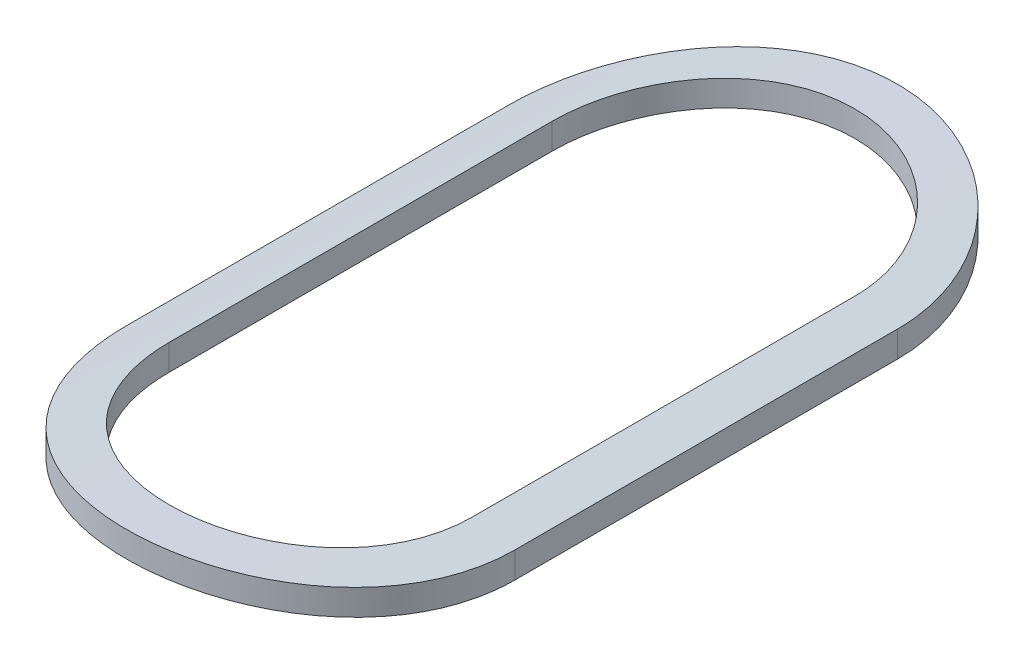
ISO-10303-21;
HEADER;
FILE_DESCRIPTION(('STEP AP214'),'2;1');
FILE_NAME('part.step','',(''),(''),'','','');
FILE_SCHEMA(('AUTOMOTIVE_DESIGN { 1 0 10303 214 1 1 1 1 }'));
ENDSEC;
DATA;
#1=APPLICATION_CONTEXT('core data for automotive mechanical design processes');
#2=APPLICATION_PROTOCOL_DEFINITION('international standard','automotive_design',2000,#1);
#3=PRODUCT_CONTEXT('',#1,'mechanical');
#4=PRODUCT('Part','Part','',(#3));
#5=PRODUCT_RELATED_PRODUCT_CATEGORY('part','',(#4));
#6=PRODUCT_DEFINITION_FORMATION('','',#4);
#7=PRODUCT_DEFINITION_CONTEXT('part definition',#1,'design');
#8=PRODUCT_DEFINITION('design','',#6,#7);
#9=PRODUCT_DEFINITION_SHAPE('','',#8);
#10=(LENGTH_UNIT() NAMED_UNIT(*) SI_UNIT(.MILLI.,.METRE.));
#11=(NAMED_UNIT(*) PLANE_ANGLE_UNIT() SI_UNIT($,.RADIAN.));
#12=(NAMED_UNIT(*) SI_UNIT($,.STERADIAN.) SOLID_ANGLE_UNIT());
#13=UNCERTAINTY_MEASURE_WITH_UNIT(LENGTH_MEASURE(1.E-05),#10,'distance_accuracy_value','');
#14=(GEOMETRIC_REPRESENTATION_CONTEXT(3) GLOBAL_UNCERTAINTY_ASSIGNED_CONTEXT((#13)) GLOBAL_UNIT_ASSIGNED_CONTEXT((#10,
#11,#12)) REPRESENTATION_CONTEXT('',''));
#15=CARTESIAN_POINT('',(0.,0.,0.));
#16=DIRECTION('',(0.,0.,1.));
#17=DIRECTION('',(1.,0.,0.));
#18=AXIS2_PLACEMENT_3D('',#15,#16,#17);
#19=CARTESIAN_POINT('',(-175.2707109821,-62.9180736437962,1.42682282483735));
#20=DIRECTION('',(0.,0.,1.));
#21=DIRECTION('',(1.,0.,0.));
#22=AXIS2_PLACEMENT_3D('',#19,#20,#21);
#23=CYLINDRICAL_SURFACE('',#22,5.);
#24=CARTESIAN_POINT('',(-174.562352977331,-57.9685050830951,-0.626714267221802));
#25=CARTESIAN_POINT('',(-174.56231819202,-57.9685236249811,-0.587075440803523));
#26=CARTESIAN_POINT('',(-174.565677996493,-57.9680294147791,-0.547451265399282));
#27=CARTESIAN_POINT('',(-174.578924725972,-57.9661536270468,-0.469375725013072));
#28=CARTESIAN_POINT('',(-174.588804133438,-57.9647730715818,-0.430923062558488));
#29=CARTESIAN_POINT('',(-174.614832857679,-57.9612616354489,-0.356226993143566));
#30=CARTESIAN_POINT('',(-174.630983979941,-57.9591305387334,-0.319984225842004));
#31=CARTESIAN_POINT('',(-174.669077247436,-57.9543647067663,-0.250723448485034));
#32=CARTESIAN_POINT('',(-174.691019134295,-57.9517299939866,-0.217705294642949));
#33=CARTESIAN_POINT('',(-174.740238549183,-57.9462315808067,-0.155598483974647));
#34=CARTESIAN_POINT('',(-174.767548783778,-57.9433665437921,-0.126535861606955));
#35=CARTESIAN_POINT('',(-174.826661618482,-57.9377423080896,-0.0733868548091715));
#36=CARTESIAN_POINT('',(-174.85846490313,-57.9349831256107,-0.049301230029893));
#37=CARTESIAN_POINT('',(-174.925826905015,-57.9298676599313,-0.00669747102001507));
#38=CARTESIAN_POINT('',(-174.961401017461,-57.9275131399999,0.0117965513089007));
#39=CARTESIAN_POINT('',(-175.035187231282,-57.9234873673329,0.0425365416853109));
#40=CARTESIAN_POINT('',(-175.073399053675,-57.9218160424669,0.0547831693542658));
#41=CARTESIAN_POINT('',(-175.151106693764,-57.9193542972137,0.0726027061890993));
#42=CARTESIAN_POINT('',(-175.190592212742,-57.9185580590577,0.0782197092632751));
#43=CARTESIAN_POINT('',(-175.269953800404,-57.9179162798542,0.082757402555431));
#44=CARTESIAN_POINT('',(-175.309829858972,-57.9180707142472,0.0816782657607643));
#45=CARTESIAN_POINT('',(-175.388537942688,-57.9193082454885,0.0728890572938922));
#46=CARTESIAN_POINT('',(-175.427375404778,-57.9203846735061,0.0652266019071842));
#47=CARTESIAN_POINT('',(-175.503207413134,-57.9233377917456,0.0435629378047652));
#48=CARTESIAN_POINT('',(-175.540201926849,-57.9252144960958,0.0295616171808006));
#49=CARTESIAN_POINT('',(-175.611444068649,-57.9295688237723,-0.00443201761331331));
#50=CARTESIAN_POINT('',(-175.64568185491,-57.9320484831863,-0.0244446862415206));
#51=CARTESIAN_POINT('',(-175.710329754601,-57.9373318406017,-0.0698773123927697));
#52=CARTESIAN_POINT('',(-175.740739797455,-57.940135544576,-0.0952973695928472));
#53=CARTESIAN_POINT('',(-175.797147093776,-57.9457827135758,-0.151084980078037));
#54=CARTESIAN_POINT('',(-175.823103896636,-57.9486263127461,-0.181493431431719));
#55=CARTESIAN_POINT('',(-175.86955966979,-57.9540098748137,-0.246267479357088));
#56=CARTESIAN_POINT('',(-175.890057044511,-57.956549748825,-0.280634228587506));
#57=CARTESIAN_POINT('',(-175.925016265224,-57.9610385580672,-0.352394026502373));
#58=CARTESIAN_POINT('',(-175.939470709579,-57.9629867678087,-0.389790719884));
#59=CARTESIAN_POINT('',(-175.961861656507,-57.9660598482316,-0.466488015576374));
#60=CARTESIAN_POINT('',(-175.969807944731,-57.9671859547476,-0.505785665031438));
#61=CARTESIAN_POINT('',(-175.975949994197,-57.9680595995502,-0.558929092149806));
#62=CARTESIAN_POINT('',(-175.977120148638,-57.9682265264067,-0.572471186339221));
#63=CARTESIAN_POINT('',(-175.978678608053,-57.9684491444339,-0.599578341048477));
#64=CARTESIAN_POINT('',(-175.979068226181,-57.9685050224289,-0.613143324503915));
#65=CARTESIAN_POINT('',(-175.979068986851,-57.9685050830926,-0.626714267221801));
#66=B_SPLINE_CURVE_WITH_KNOTS('',3,(#24,#25,#26,#27,#28,#29,#30,#31,#32,#33,#34,#35,#36,#37,#38,
#39,#40,#41,#42,#43,#44,#45,#46,#47,#48,#49,#50,#51,#52,#53,#54,#55,#56,#57,#58,#59,#60,#61,#62,
#63,#64,#65),.UNSPECIFIED.,.F.,.F.,(4,2,2,2,2,2,2,2,2,2,2,2,2,2,2,2,2,2,2,2,4),(0.,
0.118749475652929,0.237362263855814,0.356009223373581,0.474650889962778,0.594039129072952,
0.713445577251891,0.833359813547281,0.953261386262471,1.07236091244366,1.19145736183339,
1.30969958496656,1.42794389566529,1.54659318409006,1.66524465982469,1.78492258189409,
1.90463544277968,2.02449450646764,2.14417301772139,2.18493687446289,2.22563209338629),.UNSPECIFIED.);
#67=CARTESIAN_POINT('',(-174.562352977331,-57.9685050830952,-0.626714267221801));
#68=VERTEX_POINT('',#67);
#69=CARTESIAN_POINT('',(-175.97906898685,-57.9685050830925,-0.626714267221803));
#70=VERTEX_POINT('',#69);
#71=EDGE_CURVE('E173',#68,#70,#66,.T.);
#72=ORIENTED_EDGE('',*,*,#71,.T.);
#73=DIRECTION('',(0.,0.,-1.));
#74=VECTOR('',#73,1.);
#75=CARTESIAN_POINT('',(-175.97906898685,-57.9685050830925,-2.41765714717993));
#76=LINE('',#75,#74);
#77=CARTESIAN_POINT('',(-175.97906898685,-57.9685050830925,-2.41765714717993));
#78=VERTEX_POINT('',#77);
#79=EDGE_CURVE('E111',#78,#70,#76,.F.);
#80=ORIENTED_EDGE('',*,*,#79,.F.);
#81=CARTESIAN_POINT('',(-175.979068986851,-57.9685050830926,-2.41765714717993));
#82=CARTESIAN_POINT('',(-175.979103777404,-57.9685236247256,-2.45729586745361));
#83=CARTESIAN_POINT('',(-175.975743988307,-57.9680294172962,-2.49691993696254));
#84=CARTESIAN_POINT('',(-175.962497288361,-57.9661536344881,-2.57499548330385));
#85=CARTESIAN_POINT('',(-175.952617860228,-57.9647730764401,-2.61344825159397));
#86=CARTESIAN_POINT('',(-175.926588842244,-57.9612615989126,-2.68814519526376));
#87=CARTESIAN_POINT('',(-175.910437333816,-57.9591304498519,-2.72438869091649));
#88=CARTESIAN_POINT('',(-175.872343784117,-57.9543645974187,-2.79364934200575));
#89=CARTESIAN_POINT('',(-175.850402241076,-57.9517299373784,-2.82666677470834));
#90=CARTESIAN_POINT('',(-175.801186207544,-57.9462318835382,-2.88876949527433));
#91=CARTESIAN_POINT('',(-175.773879481096,-57.9433671722798,-2.91782912168118));
#92=CARTESIAN_POINT('',(-175.714767073951,-57.9377429193244,-2.97097927617986));
#93=CARTESIAN_POINT('',(-175.682959722483,-57.9349834171696,-2.99506795069907));
#94=CARTESIAN_POINT('',(-175.61557800544,-57.9298662750012,-3.03768528217945));
#95=CARTESIAN_POINT('',(-175.57998670533,-57.9275105763355,-3.05618738804311));
#96=CARTESIAN_POINT('',(-175.506189605935,-57.923485599968,-3.08692159941251));
#97=CARTESIAN_POINT('',(-175.467986932545,-57.921815517783,-3.09916105751464));
#98=CARTESIAN_POINT('',(-175.403100424651,-57.9197589158793,-3.11404347452359));
#99=CARTESIAN_POINT('',(-175.376831481638,-57.9191299886342,-3.11852632443483));
#100=CARTESIAN_POINT('',(-175.323949145474,-57.9182871387536,-3.1245127541697));
#101=CARTESIAN_POINT('',(-175.297335748446,-57.9180732207935,-3.12601630042867));
#102=CARTESIAN_POINT('',(-175.231136540235,-57.9180742725377,-3.12601344485151));
#103=CARTESIAN_POINT('',(-175.191536979936,-57.9185484483598,-3.12268739044459));
#104=CARTESIAN_POINT('',(-175.113441958173,-57.9203944948015,-3.1094729770919));
#105=CARTESIAN_POINT('',(-175.074947692914,-57.9217673023731,-3.09957776871192));
#106=CARTESIAN_POINT('',(-175.000206768985,-57.9252561689578,-3.07352532423217));
#107=CARTESIAN_POINT('',(-174.963958442602,-57.9273716685142,-3.05737280071224));
#108=CARTESIAN_POINT('',(-174.894692643812,-57.9321116511946,-3.019274720477));
#109=CARTESIAN_POINT('',(-174.861674706968,-57.9347360609899,-2.99732999819427));
#110=CARTESIAN_POINT('',(-174.799570750716,-57.9402220719574,-2.94810754576665));
#111=CARTESIAN_POINT('',(-174.770510524656,-57.9430850497233,-2.92079742410648));
#112=CARTESIAN_POINT('',(-174.717367995549,-57.9487147875814,-2.86168658221805));
#113=CARTESIAN_POINT('',(-174.693286163217,-57.9514815385547,-2.82988543783352));
#114=CARTESIAN_POINT('',(-174.650681520965,-57.9566194521663,-2.76252035496254));
#115=CARTESIAN_POINT('',(-174.632184900153,-57.9589887286847,-2.72693971569608));
#116=CARTESIAN_POINT('',(-174.601448246041,-57.9630429435685,-2.6531430263423));
#117=CARTESIAN_POINT('',(-174.589204586684,-57.9647282784311,-2.61492851824726));
#118=CARTESIAN_POINT('',(-174.574318473495,-57.9668037408559,-2.55001546572363));
#119=CARTESIAN_POINT('',(-174.569835226755,-57.9674384398504,-2.5237321116512));
#120=CARTESIAN_POINT('',(-174.563852293327,-57.9682904852838,-2.47085548452043));
#121=CARTESIAN_POINT('',(-174.562348809687,-57.9685083628436,-2.44426264936121));
#122=CARTESIAN_POINT('',(-174.562352977331,-57.9685050830951,-2.41765714717994));
#123=B_SPLINE_CURVE_WITH_KNOTS('',3,(#81,#82,#83,#84,#85,#86,#87,#88,#89,#90,#91,#92,#93,#94,
#95,#96,#97,#98,#99,#100,#101,#102,#103,#104,#105,#106,#107,#108,#109,#110,#111,#112,#113,#114,
#115,#116,#117,#118,#119,#120,#121,#122),.UNSPECIFIED.,.F.,.F.,(4,2,2,2,2,2,2,2,2,2,2,2,2,2,2,2,
2,2,2,2,4),(0.,0.118749159033299,0.237362263863262,0.356011680082915,0.474650889915929,
0.594026017222667,0.713445577112572,0.833424074530637,0.953261387365866,1.03306921841364,
1.11287794856634,1.23150381401027,1.35025356129366,1.46891404775443,1.58755744913422,
1.70694043541029,1.82633470440586,1.94628041824211,2.06615649703429,2.14600710616939,
2.22575590036766),.UNSPECIFIED.);
#124=CARTESIAN_POINT('',(-174.562352977331,-57.9685050830952,-2.41765714717993));
#125=VERTEX_POINT('',#124);
#126=EDGE_CURVE('E118',#78,#125,#123,.T.);
#127=ORIENTED_EDGE('',*,*,#126,.T.);
#128=DIRECTION('',(0.,0.,1.));
#129=VECTOR('',#128,1.);
#130=CARTESIAN_POINT('',(-174.562352977331,-57.9685050830952,-0.626714267221804));
#131=LINE('',#130,#129);
#132=EDGE_CURVE('E115',#68,#125,#131,.F.);
#133=ORIENTED_EDGE('',*,*,#132,.F.);
#134=EDGE_LOOP('',(#72,#80,#127,#133));
#135=FACE_BOUND('',#134,.T.);
#136=DIRECTION('',(0.,0.,-1.));
#137=VECTOR('',#136,1.);
#138=CARTESIAN_POINT('',(-174.362352977331,-58.0012773560523,-2.41765723119986));
#139=LINE('',#138,#137);
#140=CARTESIAN_POINT('',(-174.362352977331,-58.0012773560523,-2.41765723119986));
#141=VERTEX_POINT('',#140);
#142=CARTESIAN_POINT('',(-174.362352977331,-58.0012773560523,-0.626714249117723));
#143=VERTEX_POINT('',#142);
#144=EDGE_CURVE('E98',#141,#143,#139,.F.);
#145=ORIENTED_EDGE('',*,*,#144,.F.);
#146=CARTESIAN_POINT('',(-176.179068986851,-58.0012773560489,-2.41765711097195));
#147=CARTESIAN_POINT('',(-176.179114366647,-58.0013080368418,-2.46831226223223));
#148=CARTESIAN_POINT('',(-176.174834712648,-58.000495368357,-2.51894481522782));
#149=CARTESIAN_POINT('',(-176.157971730428,-57.9974131802428,-2.61869178573522));
#150=CARTESIAN_POINT('',(-176.145400169869,-57.995145725333,-2.66780825158377));
#151=CARTESIAN_POINT('',(-176.112294829344,-57.9893820577137,-2.76321060966572));
#152=CARTESIAN_POINT('',(-176.091759530645,-57.9858856106396,-2.80949596003764));
#153=CARTESIAN_POINT('',(-176.043341300228,-57.9780690294218,-2.89796782212495));
#154=CARTESIAN_POINT('',(-176.015458277593,-57.9737488850862,-2.94015428311358));
#155=CARTESIAN_POINT('',(-175.952792460442,-57.9647138412302,-3.01971191588156));
#156=CARTESIAN_POINT('',(-175.917941755172,-57.9599953436674,-3.05702919319327));
#157=CARTESIAN_POINT('',(-175.842463605392,-57.9507260347656,-3.12533244207462));
#158=CARTESIAN_POINT('',(-175.801834045646,-57.9461752855989,-3.15631608517652));
#159=CARTESIAN_POINT('',(-175.715588232075,-57.9377147972196,-3.21127775463436));
#160=CARTESIAN_POINT('',(-175.669936683177,-57.9338101507921,-3.23520118819019));
#161=CARTESIAN_POINT('',(-175.575213179916,-57.9271295165128,-3.27499343456619));
#162=CARTESIAN_POINT('',(-175.526145342003,-57.9243521969489,-3.29087175662187));
#163=CARTESIAN_POINT('',(-175.4424669164,-57.9209105999476,-3.31029848035997));
#164=CARTESIAN_POINT('',(-175.40839653215,-57.9198519863191,-3.31618319444103));
#165=CARTESIAN_POINT('',(-175.339792609163,-57.9184331630702,-3.32404228712557));
#166=CARTESIAN_POINT('',(-175.30525906848,-57.9180729563864,-3.32601664928691));
#167=CARTESIAN_POINT('',(-175.220141009846,-57.9180746499965,-3.32601296018807));
#168=CARTESIAN_POINT('',(-175.169539872234,-57.9188489013581,-3.32177732756786));
#169=CARTESIAN_POINT('',(-175.069756594041,-57.9218634183327,-3.3049546319076));
#170=CARTESIAN_POINT('',(-175.020575948302,-57.9241051734904,-3.29235908321068));
#171=CARTESIAN_POINT('',(-174.925099240572,-57.9298035985899,-3.25921359571951));
#172=CARTESIAN_POINT('',(-174.878800496785,-57.9332591185302,-3.23867118445097));
#173=CARTESIAN_POINT('',(-174.790312394406,-57.9410069772031,-3.19023463231934));
#174=CARTESIAN_POINT('',(-174.748122604101,-57.9452992278809,-3.16234126493844));
#175=CARTESIAN_POINT('',(-174.668569162746,-57.9543002591481,-3.09966125720396));
#176=CARTESIAN_POINT('',(-174.631258464305,-57.9590128033068,-3.06480794631405));
#177=CARTESIAN_POINT('',(-174.562978557937,-57.968295362933,-2.98933767002648));
#178=CARTESIAN_POINT('',(-174.532010050101,-57.9728653626182,-2.94872006916732));
#179=CARTESIAN_POINT('',(-174.477071165942,-57.9813827188733,-2.86249844789258));
#180=CARTESIAN_POINT('',(-174.453156151766,-57.9853250434699,-2.81685865018257));
#181=CARTESIAN_POINT('',(-174.413364405679,-57.9920847349784,-2.72213336973738));
#182=CARTESIAN_POINT('',(-174.397482636797,-57.9949028065798,-2.67305006817523));
#183=CARTESIAN_POINT('',(-174.378056703226,-57.998395644865,-2.58934537711079));
#184=CARTESIAN_POINT('',(-174.372173997171,-57.9994703023625,-2.55526505538534));
#185=CARTESIAN_POINT('',(-174.364321265333,-58.0009136885917,-2.48668093336489));
#186=CARTESIAN_POINT('',(-174.36234686283,-58.0012832069578,-2.45217765035935));
#187=CARTESIAN_POINT('',(-174.362352977331,-58.0012773560522,-2.41765723119987));
#188=B_SPLINE_CURVE_WITH_KNOTS('',3,(#146,#147,#148,#149,#150,#151,#152,#153,#154,#155,#156,
#157,#158,#159,#160,#161,#162,#163,#164,#165,#166,#167,#168,#169,#170,#171,#172,#173,#174,#175,
#176,#177,#178,#179,#180,#181,#182,#183,#184,#185,#186,#187),.UNSPECIFIED.,.F.,.F.,(4,2,2,2,2,2,
2,2,2,2,2,2,2,2,2,2,2,2,2,2,4),(0.,0.151744406498762,0.303273923270081,0.454832351871488,
0.606392655880603,0.759509268653381,0.912682071666721,1.06700998168234,1.22115504971323,
1.32471214644136,1.42826967860242,1.57985264815249,1.73158971640642,1.88318340494268,
2.03476114885404,2.18786728699564,2.34099031685207,2.49528502654273,2.64948287072659,
2.75306909479241,2.85653925190756),.UNSPECIFIED.);
#189=CARTESIAN_POINT('',(-176.17906898685,-58.0012773560489,-2.41765712907594));
#190=VERTEX_POINT('',#189);
#191=EDGE_CURVE('E21',#190,#141,#188,.T.);
#192=ORIENTED_EDGE('',*,*,#191,.F.);
#193=DIRECTION('',(0.,0.,1.));
#194=VECTOR('',#193,1.);
#195=CARTESIAN_POINT('',(-176.17906898685,-58.0012773560488,-0.626714131743577));
#196=LINE('',#195,#194);
#197=CARTESIAN_POINT('',(-176.17906898685,-58.0012773560489,-0.626714131743576));
#198=VERTEX_POINT('',#197);
#199=EDGE_CURVE('E85',#198,#190,#196,.F.);
#200=ORIENTED_EDGE('',*,*,#199,.F.);
#201=CARTESIAN_POINT('',(-174.362352977331,-58.0012773560522,-0.626714194805484));
#202=CARTESIAN_POINT('',(-174.362307610228,-58.0013080360505,-0.57605893776509));
#203=CARTESIAN_POINT('',(-174.366587284845,-58.0004953628914,-0.525426279732307));
#204=CARTESIAN_POINT('',(-174.383450306933,-57.9974131663501,-0.425679316780425));
#205=CARTESIAN_POINT('',(-174.396021852251,-57.9951457137386,-0.376562957514267));
#206=CARTESIAN_POINT('',(-174.42912685624,-57.9893821077238,-0.281161645988662));
#207=CARTESIAN_POINT('',(-174.449661692882,-57.9858857416783,-0.234877185368207));
#208=CARTESIAN_POINT('',(-174.498079590673,-57.9780691912071,-0.146405175936383));
#209=CARTESIAN_POINT('',(-174.525963033067,-57.9737489640427,-0.104217839838516));
#210=CARTESIAN_POINT('',(-174.588633036654,-57.9647133472899,-0.0246551356845011));
#211=CARTESIAN_POINT('',(-174.623488098071,-57.9599943286363,0.0126658734382841));
#212=CARTESIAN_POINT('',(-174.698966779969,-57.9507250466619,0.0809676924723666));
#213=CARTESIAN_POINT('',(-174.739591286672,-57.9461748094026,0.111947526552724));
#214=CARTESIAN_POINT('',(-174.825812375784,-57.9377170390507,0.166892016112585));
#215=CARTESIAN_POINT('',(-174.87144229385,-57.9338143117028,0.19080516334791));
#216=CARTESIAN_POINT('',(-174.966151942711,-57.9271323998905,0.230604679256934));
#217=CARTESIAN_POINT('',(-175.015231213887,-57.9243530660682,0.246492115038185));
#218=CARTESIAN_POINT('',(-175.114880505209,-57.9202565918597,0.26962201929122));
#219=CARTESIAN_POINT('',(-175.165428418801,-57.9189238293954,0.276956915475213));
#220=CARTESIAN_POINT('',(-175.267055002908,-57.9178168560988,0.283061393319289));
#221=CARTESIAN_POINT('',(-175.318133643187,-57.9180425569635,0.281831460265704));
#222=CARTESIAN_POINT('',(-175.418735850112,-57.9200148838634,0.270912109893538));
#223=CARTESIAN_POINT('',(-175.468270643492,-57.9217435791224,0.26132242119046));
#224=CARTESIAN_POINT('',(-175.565015772011,-57.9265075655432,0.23411336751583));
#225=CARTESIAN_POINT('',(-175.612226042043,-57.9295428932801,0.216493777771071));
#226=CARTESIAN_POINT('',(-175.703274511403,-57.9366092879403,0.173628560612964));
#227=CARTESIAN_POINT('',(-175.74709328936,-57.9406456025222,0.148342581598753));
#228=CARTESIAN_POINT('',(-175.829901605459,-57.9492667840127,0.090892866448085));
#229=CARTESIAN_POINT('',(-175.868890850454,-57.9538516841867,0.0587287131371593));
#230=CARTESIAN_POINT('',(-175.9415208449,-57.9631391168093,-0.0121100798365121));
#231=CARTESIAN_POINT('',(-175.975077241772,-57.9678423940488,-0.0508711523919565));
#232=CARTESIAN_POINT('',(-176.03523420761,-57.9767749976083,-0.133529440751058));
#233=CARTESIAN_POINT('',(-176.061832821042,-57.9810041904932,-0.177428095500789));
#234=CARTESIAN_POINT('',(-176.107341494261,-57.9885113367211,-0.269229492060068));
#235=CARTESIAN_POINT('',(-176.126235445796,-57.9917872930662,-0.317140372930593));
#236=CARTESIAN_POINT('',(-176.155655935524,-57.9969864261021,-0.415497139995552));
#237=CARTESIAN_POINT('',(-176.166194958724,-57.9989116207771,-0.465939123490161));
#238=CARTESIAN_POINT('',(-176.174624694251,-58.0004580940873,-0.535096769098611));
#239=CARTESIAN_POINT('',(-176.176291948775,-58.0007650160899,-0.553395323985865));
#240=CARTESIAN_POINT('',(-176.178512665097,-58.0011744553454,-0.59003125968093));
#241=CARTESIAN_POINT('',(-176.179067998095,-58.0012773160009,-0.60836852318657));
#242=CARTESIAN_POINT('',(-176.179068986851,-58.0012773560489,-0.626714131743576));
#243=B_SPLINE_CURVE_WITH_KNOTS('',3,(#201,#202,#203,#204,#205,#206,#207,#208,#209,#210,#211,
#212,#213,#214,#215,#216,#217,#218,#219,#220,#221,#222,#223,#224,#225,#226,#227,#228,#229,#230,
#231,#232,#233,#234,#235,#236,#237,#238,#239,#240,#241,#242),.UNSPECIFIED.,.F.,.F.,(4,2,2,2,2,2,
2,2,2,2,2,2,2,2,2,2,2,2,2,2,4),(0.,0.151744722104375,0.303273924606033,0.454829359511636,
0.606392658633331,0.759525593615979,0.912682076236843,1.06692882079773,1.22115505113773,
1.37369863297175,1.52623357170143,1.67697335211143,1.82771735229263,1.97926898039391,
2.13082980300056,2.28455551072836,2.43832437782105,2.59241310359363,2.74627113391337,
2.80137542981596,2.85638691513427),.UNSPECIFIED.);
#244=EDGE_CURVE('E99',#143,#198,#243,.T.);
#245=ORIENTED_EDGE('',*,*,#244,.F.);
#246=EDGE_LOOP('',(#145,#192,#200,#245));
#247=FACE_BOUND('',#246,.T.);
#248=ADVANCED_FACE('F17',(#135,#247),#23,.T.);
#249=CARTESIAN_POINT('',(-174.362352977331,-67.7980736437963,-2.41765723119986));
#250=DIRECTION('',(1.,0.,0.));
#251=DIRECTION('',(0.,0.,-1.));
#252=AXIS2_PLACEMENT_3D('',#249,#250,#251);
#253=PLANE('',#252);
#254=ORIENTED_EDGE('',*,*,#144,.T.);
#255=DIRECTION('',(0.,-1.,0.));
#256=VECTOR('',#255,1.);
#257=CARTESIAN_POINT('',(-174.362352977331,-67.7980736437963,-0.626714231013645));
#258=LINE('',#257,#256);
#259=CARTESIAN_POINT('',(-174.362352977331,-58.1233592899298,-0.626714249117723));
#260=VERTEX_POINT('',#259);
#261=EDGE_CURVE('E168',#260,#143,#258,.F.);
#262=ORIENTED_EDGE('',*,*,#261,.F.);
#263=DIRECTION('',(0.,0.,1.));
#264=VECTOR('',#263,1.);
#265=CARTESIAN_POINT('',(-174.362352977331,-58.1233592899298,1.42682282483735));
#266=LINE('',#265,#264);
#267=CARTESIAN_POINT('',(-174.362352977331,-58.1233592899298,-2.41765723119986));
#268=VERTEX_POINT('',#267);
#269=EDGE_CURVE('E106',#260,#268,#266,.F.);
#270=ORIENTED_EDGE('',*,*,#269,.T.);
#271=DIRECTION('',(0.,-1.,0.));
#272=VECTOR('',#271,1.);
#273=CARTESIAN_POINT('',(-174.362352977331,-67.7980736437963,-2.41765723119986));
#274=LINE('',#273,#272);
#275=EDGE_CURVE('E93',#141,#268,#274,.T.);
#276=ORIENTED_EDGE('',*,*,#275,.F.);
#277=EDGE_LOOP('',(#254,#262,#270,#276));
#278=FACE_BOUND('',#277,.T.);
#279=ADVANCED_FACE('F105',(#278),#253,.T.);
#280=CARTESIAN_POINT('',(-175.270710982091,-67.7980736437963,-2.41765714717993));
#281=DIRECTION('',(0.,-1.,0.));
#282=DIRECTION('',(0.,0.,-1.));
#283=AXIS2_PLACEMENT_3D('',#280,#281,#282);
#284=CYLINDRICAL_SURFACE('',#283,0.908358004759563);
#285=CARTESIAN_POINT('',(-174.362352977331,-58.1233592899298,-2.41765723119986));
#286=CARTESIAN_POINT('',(-174.362307508087,-58.1233907487974,-2.46829006558496));
#287=CARTESIAN_POINT('',(-174.366583515268,-58.1225580940019,-2.5188998136944));
#288=CARTESIAN_POINT('',(-174.383430778239,-58.1194004113025,-2.61859933749041));
#289=CARTESIAN_POINT('',(-174.39598999349,-58.117077549709,-2.6676912112984));
#290=CARTESIAN_POINT('',(-174.429060709074,-58.1111735224873,-2.7630445756938));
#291=CARTESIAN_POINT('',(-174.449573609082,-58.1075921353965,-2.80930556644784));
#292=CARTESIAN_POINT('',(-174.497937169855,-58.0995859896331,-2.89773356565288));
#293=CARTESIAN_POINT('',(-174.525788012592,-58.0951612100462,-2.93990047254104));
#294=CARTESIAN_POINT('',(-174.588397099989,-58.085904772832,-3.01944777737922));
#295=CARTESIAN_POINT('',(-174.623226610255,-58.081069241265,-3.05677164020415));
#296=CARTESIAN_POINT('',(-174.698663268815,-58.0715693076407,-3.12509326690143));
#297=CARTESIAN_POINT('',(-174.739272529207,-58.0669049689299,-3.15608870804826));
#298=CARTESIAN_POINT('',(-174.825497694019,-58.0582304523265,-3.21109000892669));
#299=CARTESIAN_POINT('',(-174.871150660687,-58.0542257407744,-3.23503864082376));
#300=CARTESIAN_POINT('',(-174.965885663096,-58.0473727183835,-3.27487946931475));
#301=CARTESIAN_POINT('',(-175.014963568519,-58.0445230419366,-3.29078118541042));
#302=CARTESIAN_POINT('',(-175.098702024609,-58.0409889888468,-3.31025170642124));
#303=CARTESIAN_POINT('',(-175.132821344127,-58.0399011389449,-3.31615387339387));
#304=CARTESIAN_POINT('',(-175.201525922221,-58.0384431136628,-3.3240363526466));
#305=CARTESIAN_POINT('',(-175.236111182314,-58.0380729406222,-3.32601665214202));
#306=CARTESIAN_POINT('',(-175.321258456786,-58.0380746710759,-3.32601296026643));
#307=CARTESIAN_POINT('',(-175.371836963261,-58.0388672527012,-3.32178104961697));
#308=CARTESIAN_POINT('',(-175.471574586083,-58.0419531667419,-3.30497382645223));
#309=CARTESIAN_POINT('',(-175.52073221257,-58.0442480187177,-3.29239006578485));
#310=CARTESIAN_POINT('',(-175.616162592886,-58.0500815690681,-3.25927767653368));
#311=CARTESIAN_POINT('',(-175.662438096026,-58.0536190599888,-3.23875675841849));
#312=CARTESIAN_POINT('',(-175.750883909833,-58.0615514085309,-3.19037288799649));
#313=CARTESIAN_POINT('',(-175.793054632266,-58.0659461800224,-3.16251067316249));
#314=CARTESIAN_POINT('',(-175.872596881583,-58.0751658757116,-3.09988640104864));
#315=CARTESIAN_POINT('',(-175.909912996327,-58.0799948540251,-3.06505455514611));
#316=CARTESIAN_POINT('',(-175.978209099492,-58.089508819769,-2.98962671214734));
#317=CARTESIAN_POINT('',(-176.009188374133,-58.0941937909281,-2.94903006657843));
#318=CARTESIAN_POINT('',(-176.064165819666,-58.1029294932167,-2.86282960837903));
#319=CARTESIAN_POINT('',(-176.08810579871,-58.1069748164038,-2.81718812671691));
#320=CARTESIAN_POINT('',(-176.127945548409,-58.1139129101381,-2.72245101714131));
#321=CARTESIAN_POINT('',(-176.143850407871,-58.1168064099118,-2.67335759791291));
#322=CARTESIAN_POINT('',(-176.16331929116,-58.1203956454695,-2.58959400861245));
#323=CARTESIAN_POINT('',(-176.16921906572,-58.1215008065872,-2.5554660093215));
#324=CARTESIAN_POINT('',(-176.177094869952,-58.1229852590355,-2.48678312198861));
#325=CARTESIAN_POINT('',(-176.179075208483,-58.1233653474631,-2.45222874480353));
#326=CARTESIAN_POINT('',(-176.179068986851,-58.1233592899264,-2.41765711097195));
#327=B_SPLINE_CURVE_WITH_KNOTS('',3,(#285,#286,#287,#288,#289,#290,#291,#292,#293,#294,#295,
#296,#297,#298,#299,#300,#301,#302,#303,#304,#305,#306,#307,#308,#309,#310,#311,#312,#313,#314,
#315,#316,#317,#318,#319,#320,#321,#322,#323,#324,#325,#326),.UNSPECIFIED.,.F.,.F.,(4,2,2,2,2,2,
2,2,2,2,2,2,2,2,2,2,2,2,2,2,4),(0.,0.151676573539617,0.303133153264474,0.454616398136906,
0.606103399928022,0.759224399951092,0.912401499463676,1.06679024866685,1.22099592648086,
1.32470792044237,1.42842025248846,1.5799354783994,1.73160420066226,1.88312595448825,
2.03463249293714,2.18773973988131,2.34086422326659,2.49522108091863,2.64948005828159,
2.75321740397158,2.85684064181505),.UNSPECIFIED.);
#328=CARTESIAN_POINT('',(-176.17906898685,-58.1233592899262,-2.41765712907594));
#329=VERTEX_POINT('',#328);
#330=EDGE_CURVE('E150',#268,#329,#327,.T.);
#331=ORIENTED_EDGE('',*,*,#330,.T.);
#332=DIRECTION('',(0.,1.,0.));
#333=VECTOR('',#332,1.);
#334=CARTESIAN_POINT('',(-176.17906898685,-67.7980736437963,-2.41765711097195));
#335=LINE('',#334,#333);
#336=EDGE_CURVE('E95',#190,#329,#335,.F.);
#337=ORIENTED_EDGE('',*,*,#336,.F.);
#338=ORIENTED_EDGE('',*,*,#191,.T.);
#339=ORIENTED_EDGE('',*,*,#275,.T.);
#340=EDGE_LOOP('',(#331,#337,#338,#339));
#341=FACE_BOUND('',#340,.T.);
#342=ADVANCED_FACE('F91',(#341),#284,.T.);
#343=CARTESIAN_POINT('',(-176.17906898685,-67.7980736437963,-0.626714131743577));
#344=DIRECTION('',(-1.,0.,0.));
#345=DIRECTION('',(0.,0.,1.));
#346=AXIS2_PLACEMENT_3D('',#343,#344,#345);
#347=PLANE('',#346);
#348=ORIENTED_EDGE('',*,*,#199,.T.);
#349=ORIENTED_EDGE('',*,*,#336,.T.);
#350=DIRECTION('',(0.,0.,1.));
#351=VECTOR('',#350,1.);
#352=CARTESIAN_POINT('',(-176.17906898685,-58.1233592899262,1.42682282483735));
#353=LINE('',#352,#351);
#354=CARTESIAN_POINT('',(-176.17906898685,-58.1233592899263,-0.626714131743576));
#355=VERTEX_POINT('',#354);
#356=EDGE_CURVE('E149',#329,#355,#353,.T.);
#357=ORIENTED_EDGE('',*,*,#356,.T.);
#358=DIRECTION('',(0.,-1.,0.));
#359=VECTOR('',#358,1.);
#360=CARTESIAN_POINT('',(-176.179068986851,-67.7980736437963,-0.626714131743577));
#361=LINE('',#360,#359);
#362=EDGE_CURVE('E114',#198,#355,#361,.T.);
#363=ORIENTED_EDGE('',*,*,#362,.F.);
#364=EDGE_LOOP('',(#348,#349,#357,#363));
#365=FACE_BOUND('',#364,.T.);
#366=ADVANCED_FACE('F161',(#365),#347,.T.);
#367=CARTESIAN_POINT('',(-175.270710982091,-67.7980736437963,-0.626714267221804));
#368=DIRECTION('',(0.,-1.,0.));
#369=DIRECTION('',(0.,0.,-1.));
#370=AXIS2_PLACEMENT_3D('',#367,#368,#369);
#371=CYLINDRICAL_SURFACE('',#370,0.908358004759566);
#372=ORIENTED_EDGE('',*,*,#362,.T.);
#373=CARTESIAN_POINT('',(-176.179068986851,-58.1233592899264,-0.626714131743576));
#374=CARTESIAN_POINT('',(-176.179114446603,-58.1233907485787,-0.576081195459802));
#375=CARTESIAN_POINT('',(-176.174838422648,-58.1225580897244,-0.525471345895403));
#376=CARTESIAN_POINT('',(-176.157991127388,-58.1194003997606,-0.425771828563205));
#377=CARTESIAN_POINT('',(-176.145431929868,-58.1170775409422,-0.376680056875159));
#378=CARTESIAN_POINT('',(-176.112361553414,-58.1111735772115,-0.281327727364065));
#379=CARTESIAN_POINT('',(-176.091849115024,-58.1075922730235,-0.235067619300143));
#380=CARTESIAN_POINT('',(-176.043485890323,-58.0995861592083,-0.146639470927789));
#381=CARTESIAN_POINT('',(-176.015634633861,-58.0951612955449,-0.104471693024739));
#382=CARTESIAN_POINT('',(-175.953021385381,-58.0859042740399,-0.024919334003028));
#383=CARTESIAN_POINT('',(-175.918187540088,-58.0810682105351,0.0124082492955883));
#384=CARTESIAN_POINT('',(-175.842750357195,-58.0715683041891,0.0807284572434038));
#385=CARTESIAN_POINT('',(-175.802146131966,-58.0669044879832,0.111720105475298));
#386=CARTESIAN_POINT('',(-175.715945624996,-58.0582327504514,0.166704262520825));
#387=CARTESIAN_POINT('',(-175.670314238439,-58.0542300021296,0.190642622401256));
#388=CARTESIAN_POINT('',(-175.575593079715,-58.0473756738766,0.230490709869121));
#389=CARTESIAN_POINT('',(-175.526503780488,-58.0445239368788,0.246401532964878));
#390=CARTESIAN_POINT('',(-175.426853922194,-58.0403203967009,0.269567104879063));
#391=CARTESIAN_POINT('',(-175.376316621058,-58.0389518062641,0.276918803995097));
#392=CARTESIAN_POINT('',(-175.274707415901,-58.0378109010495,0.283059522950892));
#393=CARTESIAN_POINT('',(-175.223635544434,-58.0380384896276,0.281849061206249));
#394=CARTESIAN_POINT('',(-175.123074256872,-58.0400512285701,0.270973941925735));
#395=CARTESIAN_POINT('',(-175.073573086522,-58.0418171056946,0.261413892656032));
#396=CARTESIAN_POINT('',(-174.976890364572,-58.0466863774311,0.234276436124936));
#397=CARTESIAN_POINT('',(-174.929708880638,-58.0497898110341,0.216698795141902));
#398=CARTESIAN_POINT('',(-174.838699775617,-58.0570178013663,0.173924849075383));
#399=CARTESIAN_POINT('',(-174.794892373643,-58.0611479683555,0.148686511262394));
#400=CARTESIAN_POINT('',(-174.712096891517,-58.069972323252,0.0913393561729826));
#401=CARTESIAN_POINT('',(-174.673109129307,-58.0746665483288,0.0592300860158281));
#402=CARTESIAN_POINT('',(-174.600442886401,-58.0841822439289,-0.0115193420774998));
#403=CARTESIAN_POINT('',(-174.56685279796,-58.0890045669733,-0.050250222232914));
#404=CARTESIAN_POINT('',(-174.506622797726,-58.0981669479775,-0.132855688778126));
#405=CARTESIAN_POINT('',(-174.47998483229,-58.1025068706867,-0.176731710659918));
#406=CARTESIAN_POINT('',(-174.43439002292,-58.1102149499786,-0.268504529610235));
#407=CARTESIAN_POINT('',(-174.415450324213,-58.1135809326986,-0.316410017847461));
#408=CARTESIAN_POINT('',(-174.385939598495,-58.118927019594,-0.414768026127681));
#409=CARTESIAN_POINT('',(-174.375356090718,-58.1209091901097,-0.465216627426395));
#410=CARTESIAN_POINT('',(-174.366855256612,-58.1225082290762,-0.534502478143327));
#411=CARTESIAN_POINT('',(-174.365166263151,-58.1228270554447,-0.552919109793358));
#412=CARTESIAN_POINT('',(-174.362916563611,-58.1232523920094,-0.589792505901813));
#413=CARTESIAN_POINT('',(-174.362353963208,-58.1233592586682,-0.608249150633623));
#414=CARTESIAN_POINT('',(-174.362352977331,-58.1233592899297,-0.626714231013644));
#415=B_SPLINE_CURVE_WITH_KNOTS('',3,(#373,#374,#375,#376,#377,#378,#379,#380,#381,#382,#383,
#384,#385,#386,#387,#388,#389,#390,#391,#392,#393,#394,#395,#396,#397,#398,#399,#400,#401,#402,
#403,#404,#405,#406,#407,#408,#409,#410,#411,#412,#413,#414),.UNSPECIFIED.,.F.,.F.,(4,2,2,2,2,2,
2,2,2,2,2,2,2,2,2,2,2,2,2,2,4),(0.,0.151676877592131,0.303133153923811,0.454613424287319,
0.606103401348549,0.759240660666674,0.912401501877931,1.0667092457615,1.22099592575242,
1.37351743374598,1.52602970705535,1.6766581962706,1.82729107675311,1.97876586646993,
2.13025064335472,2.28400724264753,2.43780684247867,2.5919471251964,2.7458567469353,
2.80131963706077,2.8566891732625),.UNSPECIFIED.);
#416=EDGE_CURVE('E142',#355,#260,#415,.T.);
#417=ORIENTED_EDGE('',*,*,#416,.T.);
#418=ORIENTED_EDGE('',*,*,#261,.T.);
#419=ORIENTED_EDGE('',*,*,#244,.T.);
#420=EDGE_LOOP('',(#372,#417,#418,#419));
#421=FACE_BOUND('',#420,.T.);
#422=ADVANCED_FACE('F155',(#421),#371,.T.);
#423=CARTESIAN_POINT('',(-175.97906898685,-67.7980736437963,-2.41765714717993));
#424=DIRECTION('',(1.,0.,0.));
#425=DIRECTION('',(0.,0.,-1.));
#426=AXIS2_PLACEMENT_3D('',#423,#424,#425);
#427=PLANE('',#426);
#428=ORIENTED_EDGE('',*,*,#79,.T.);
#429=DIRECTION('',(0.,-1.,0.));
#430=VECTOR('',#429,1.);
#431=CARTESIAN_POINT('',(-175.979068986851,-67.7980736437963,-0.626714267221805));
#432=LINE('',#431,#430);
#433=CARTESIAN_POINT('',(-175.97906898685,-58.0897583126371,-0.626714267221803));
#434=VERTEX_POINT('',#433);
#435=EDGE_CURVE('E211',#70,#434,#432,.T.);
#436=ORIENTED_EDGE('',*,*,#435,.T.);
#437=DIRECTION('',(0.,0.,1.));
#438=VECTOR('',#437,1.);
#439=CARTESIAN_POINT('',(-175.97906898685,-58.0897583126371,1.42682282483735));
#440=LINE('',#439,#438);
#441=CARTESIAN_POINT('',(-175.979068986851,-58.0897583126371,-2.41765714717993));
#442=VERTEX_POINT('',#441);
#443=EDGE_CURVE('E148',#434,#442,#440,.F.);
#444=ORIENTED_EDGE('',*,*,#443,.T.);
#445=DIRECTION('',(0.,-1.,0.));
#446=VECTOR('',#445,1.);
#447=CARTESIAN_POINT('',(-175.979068986851,-67.7980736437963,-2.41765714717993));
#448=LINE('',#447,#446);
#449=EDGE_CURVE('E113',#442,#78,#448,.F.);
#450=ORIENTED_EDGE('',*,*,#449,.T.);
#451=EDGE_LOOP('',(#428,#436,#444,#450));
#452=FACE_BOUND('',#451,.T.);
#453=ADVANCED_FACE('F160',(#452),#427,.T.);
#454=CARTESIAN_POINT('',(-175.270710982091,-67.7980736437963,-2.41765714717993));
#455=DIRECTION('',(0.,-1.,0.));
#456=DIRECTION('',(0.,0.,-1.));
#457=AXIS2_PLACEMENT_3D('',#454,#455,#456);
#458=CYLINDRICAL_SURFACE('',#457,0.70835800475956);
#459=ORIENTED_EDGE('',*,*,#126,.F.);
#460=ORIENTED_EDGE('',*,*,#449,.F.);
#461=CARTESIAN_POINT('',(-175.979068986851,-58.0897583126371,-2.41765714717993));
#462=CARTESIAN_POINT('',(-175.979103823825,-58.0897773193173,-2.45728532548061));
#463=CARTESIAN_POINT('',(-175.975745766002,-58.0892709603473,-2.49689862464224));
#464=CARTESIAN_POINT('',(-175.96250652588,-58.0873491673296,-2.57495175749005));
#465=CARTESIAN_POINT('',(-175.952632958375,-58.0859347945464,-2.61339290628657));
#466=CARTESIAN_POINT('',(-175.926620381989,-58.0823374833879,-2.68806671186276));
#467=CARTESIAN_POINT('',(-175.910479511476,-58.0801543166689,-2.72429870873521));
#468=CARTESIAN_POINT('',(-175.872411931413,-58.0752722557883,-2.79353868796156));
#469=CARTESIAN_POINT('',(-175.850485675471,-58.0725734020641,-2.82654692279918));
#470=CARTESIAN_POINT('',(-175.80129648344,-58.0669404371545,-2.888644953636));
#471=CARTESIAN_POINT('',(-175.773999702285,-58.0640049075328,-2.91770781371478));
#472=CARTESIAN_POINT('',(-175.714906709256,-58.0582413500368,-2.97086688228541));
#473=CARTESIAN_POINT('',(-175.683108828381,-58.0554133625346,-2.9949612402857));
#474=CARTESIAN_POINT('',(-175.615736695995,-58.0501681877243,-3.03759732535123));
#475=CARTESIAN_POINT('',(-175.580144708091,-58.0477530806859,-3.05611127329645));
#476=CARTESIAN_POINT('',(-175.506342176922,-58.0436261621531,-3.08686830318183));
#477=CARTESIAN_POINT('',(-175.468134765997,-58.0419135259689,-3.0991187425757));
#478=CARTESIAN_POINT('',(-175.403219892086,-58.039803494658,-3.11402166181839));
#479=CARTESIAN_POINT('',(-175.376927816787,-58.0391579362253,-3.11851265250559));
#480=CARTESIAN_POINT('',(-175.323997946818,-58.0382927919896,-3.12450998863535));
#481=CARTESIAN_POINT('',(-175.297360148436,-58.0380732107631,-3.12601630201218));
#482=CARTESIAN_POINT('',(-175.231147314035,-58.0380742866823,-3.12601344452794));
#483=CARTESIAN_POINT('',(-175.191558590165,-58.0385598569114,-3.12268917863146));
#484=CARTESIAN_POINT('',(-175.11348543525,-58.040450274787,-3.10948220461775));
#485=CARTESIAN_POINT('',(-175.075002198062,-58.0418560799476,-3.09959266511279));
#486=CARTESIAN_POINT('',(-175.000283479024,-58.0454288657017,-3.07355615384112));
#487=CARTESIAN_POINT('',(-174.964046296148,-58.0475952617727,-3.05741398630721));
#488=CARTESIAN_POINT('',(-174.89480072162,-58.0524495488461,-3.01934128292259));
#489=CARTESIAN_POINT('',(-174.861791875744,-58.0551373663256,-2.99741156298768));
#490=CARTESIAN_POINT('',(-174.799692901944,-58.0607573211762,-2.94821568978994));
#491=CARTESIAN_POINT('',(-174.77062979069,-58.063690940303,-2.92091560160102));
#492=CARTESIAN_POINT('',(-174.717478981725,-58.0694603501534,-2.86182445326007));
#493=CARTESIAN_POINT('',(-174.693391759981,-58.0722961314968,-2.83003296397197));
#494=CARTESIAN_POINT('',(-174.650768658495,-58.0775636929608,-2.76267758362801));
#495=CARTESIAN_POINT('',(-174.632260255085,-58.0799934480351,-2.72709615278277));
#496=CARTESIAN_POINT('',(-174.60150095167,-58.0841518042748,-2.65329391387783));
#497=CARTESIAN_POINT('',(-174.589246403311,-58.0858808141172,-2.61507465947214));
#498=CARTESIAN_POINT('',(-174.574340055347,-58.088011130352,-2.55013363717174));
#499=CARTESIAN_POINT('',(-174.569848790007,-58.0886629126243,-2.52382757904223));
#500=CARTESIAN_POINT('',(-174.563855029352,-58.0895379244293,-2.47090401199242));
#501=CARTESIAN_POINT('',(-174.562348764728,-58.0897616944218,-2.44428693860739));
#502=CARTESIAN_POINT('',(-174.562352977331,-58.0897583126398,-2.41765714717993));
#503=B_SPLINE_CURVE_WITH_KNOTS('',3,(#461,#462,#463,#464,#465,#466,#467,#468,#469,#470,#471,
#472,#473,#474,#475,#476,#477,#478,#479,#480,#481,#482,#483,#484,#485,#486,#487,#488,#489,#490,
#491,#492,#493,#494,#495,#496,#497,#498,#499,#500,#501,#502),.UNSPECIFIED.,.F.,.F.,(4,2,2,2,2,2,
2,2,2,2,2,2,2,2,2,2,2,2,2,2,4),(0.,0.118717120276531,0.237295738850607,0.355909606852812,
0.474514177602852,0.593891627580052,0.713313459053383,0.833320307373965,0.953185863457992,
1.03306677770102,1.11294855013568,1.23154197581426,1.35025899575977,1.46888497935199,
1.5874942482517,1.70687857869056,1.82627432356595,1.94624884332563,2.06615329248638,
2.14607569142828,2.2258971039024),.UNSPECIFIED.);
#504=CARTESIAN_POINT('',(-174.562352977331,-58.0897583126398,-2.41765714717993));
#505=VERTEX_POINT('',#504);
#506=EDGE_CURVE('E125',#442,#505,#503,.T.);
#507=ORIENTED_EDGE('',*,*,#506,.T.);
#508=DIRECTION('',(0.,1.,0.));
#509=VECTOR('',#508,1.);
#510=CARTESIAN_POINT('',(-174.562352977331,-67.7980736437963,-2.41765714717993));
#511=LINE('',#510,#509);
#512=EDGE_CURVE('E117',#125,#505,#511,.F.);
#513=ORIENTED_EDGE('',*,*,#512,.F.);
#514=EDGE_LOOP('',(#459,#460,#507,#513));
#515=FACE_BOUND('',#514,.T.);
#516=ADVANCED_FACE('F177',(#515),#458,.F.);
#517=CARTESIAN_POINT('',(-174.562352977331,-67.7980736437963,-0.626714267221804));
#518=DIRECTION('',(-1.,0.,0.));
#519=DIRECTION('',(0.,0.,1.));
#520=AXIS2_PLACEMENT_3D('',#517,#518,#519);
#521=PLANE('',#520);
#522=ORIENTED_EDGE('',*,*,#132,.T.);
#523=ORIENTED_EDGE('',*,*,#512,.T.);
#524=DIRECTION('',(0.,0.,1.));
#525=VECTOR('',#524,1.);
#526=CARTESIAN_POINT('',(-174.562352977331,-58.0897583126398,1.42682282483735));
#527=LINE('',#526,#525);
#528=CARTESIAN_POINT('',(-174.562352977331,-58.0897583126398,-0.626714267221804));
#529=VERTEX_POINT('',#528);
#530=EDGE_CURVE('E31',#505,#529,#527,.T.);
#531=ORIENTED_EDGE('',*,*,#530,.T.);
#532=DIRECTION('',(0.,-1.,0.));
#533=VECTOR('',#532,1.);
#534=CARTESIAN_POINT('',(-174.562352977331,-67.7980736437963,-0.626714267221805));
#535=LINE('',#534,#533);
#536=EDGE_CURVE('E39',#529,#68,#535,.F.);
#537=ORIENTED_EDGE('',*,*,#536,.T.);
#538=EDGE_LOOP('',(#522,#523,#531,#537));
#539=FACE_BOUND('',#538,.T.);
#540=ADVANCED_FACE('F180',(#539),#521,.T.);
#541=CARTESIAN_POINT('',(-175.270710982091,-67.7980736437963,-0.626714267221804));
#542=DIRECTION('',(0.,-1.,0.));
#543=DIRECTION('',(0.,0.,-1.));
#544=AXIS2_PLACEMENT_3D('',#541,#542,#543);
#545=CYLINDRICAL_SURFACE('',#544,0.708358004759557);
#546=ORIENTED_EDGE('',*,*,#435,.F.);
#547=ORIENTED_EDGE('',*,*,#71,.F.);
#548=ORIENTED_EDGE('',*,*,#536,.F.);
#549=CARTESIAN_POINT('',(-174.562352977331,-58.0897583126398,-0.626714267221804));
#550=CARTESIAN_POINT('',(-174.562318145595,-58.0897773195768,-0.587085984664521));
#551=CARTESIAN_POINT('',(-174.565676218471,-58.0892709578146,-0.547472581488876));
#552=CARTESIAN_POINT('',(-174.578915487503,-58.0873491598382,-0.469419454489808));
#553=CARTESIAN_POINT('',(-174.588789034667,-58.0859347896541,-0.430978409646093));
#554=CARTESIAN_POINT('',(-174.614801319062,-58.0823375206832,-0.356305473530946));
#555=CARTESIAN_POINT('',(-174.63094180509,-58.0801544073935,-0.32007420216796));
#556=CARTESIAN_POINT('',(-174.669009104071,-58.0752723674002,-0.250834097224616));
#557=CARTESIAN_POINT('',(-174.690935702216,-58.0725734598465,-0.217825144078313));
#558=CARTESIAN_POINT('',(-174.740128265924,-58.0669401276528,-0.155723033178578));
#559=CARTESIAN_POINT('',(-174.767428546325,-58.0640042649716,-0.126657183513451));
#560=CARTESIAN_POINT('',(-174.826521965403,-58.0582407250733,-0.073499259568437));
#561=CARTESIAN_POINT('',(-174.858315788992,-58.055413064432,-0.0494079448948426));
#562=CARTESIAN_POINT('',(-174.925668239175,-58.050169605451,-0.00678541839164751));
#563=CARTESIAN_POINT('',(-174.961243063664,-58.0477557051998,0.0117204509504514));
#564=CARTESIAN_POINT('',(-175.035034715016,-58.0436279722361,0.0424832521612657));
#565=CARTESIAN_POINT('',(-175.073251256905,-58.04191406415,0.0547408568645895));
#566=CARTESIAN_POINT('',(-175.150958833637,-58.039389467019,0.072577130590677));
#567=CARTESIAN_POINT('',(-175.190439041557,-58.0385725234622,0.0782020696645994));
#568=CARTESIAN_POINT('',(-175.269791794184,-58.0379124748554,0.0827569850264527));
#569=CARTESIAN_POINT('',(-175.309664327784,-58.0380693423134,0.081687150317081));
#570=CARTESIAN_POINT('',(-175.388352295255,-58.0393342663873,0.0729192762619346));
#571=CARTESIAN_POINT('',(-175.427173427452,-58.0404351533805,0.065271195929761));
#572=CARTESIAN_POINT('',(-175.502975148297,-58.0434564145505,0.0436423239919765));
#573=CARTESIAN_POINT('',(-175.539955702819,-58.0453768039153,0.0296614150178257));
#574=CARTESIAN_POINT('',(-175.611179340295,-58.049833671042,-0.00428807522334952));
#575=CARTESIAN_POINT('',(-175.645412145253,-58.0523723305684,-0.0242779208018678));
#576=CARTESIAN_POINT('',(-175.710054903811,-58.0577824317937,-0.0696615660812051));
#577=CARTESIAN_POINT('',(-175.740464774272,-58.0606538807275,-0.0950554832766049));
#578=CARTESIAN_POINT('',(-175.79689048327,-58.0664400559017,-0.150801090364874));
#579=CARTESIAN_POINT('',(-175.822863881165,-58.0693549382954,-0.181195735600862));
#580=CARTESIAN_POINT('',(-175.869355359518,-58.0748748078814,-0.245945996404013));
#581=CARTESIAN_POINT('',(-175.889871850744,-58.0774797046738,-0.280302761704518));
#582=CARTESIAN_POINT('',(-175.92487201698,-58.0820849560916,-0.352049620468011));
#583=CARTESIAN_POINT('',(-175.939347968522,-58.0840845358644,-0.389443524738111));
#584=CARTESIAN_POINT('',(-175.961781415035,-58.0872401588695,-0.466140821923899));
#585=CARTESIAN_POINT('',(-175.969748690355,-58.0883974674652,-0.505441255467462));
#586=CARTESIAN_POINT('',(-175.975923787225,-58.0892978114265,-0.55864552841197));
#587=CARTESIAN_POINT('',(-175.977103768341,-58.0894703629771,-0.572244014577247));
#588=CARTESIAN_POINT('',(-175.978675324785,-58.0897004871399,-0.599464474620642));
#589=CARTESIAN_POINT('',(-175.979068224747,-58.0897582529317,-0.613086370355169));
#590=CARTESIAN_POINT('',(-175.979068986851,-58.0897583126371,-0.626714267221804));
#591=B_SPLINE_CURVE_WITH_KNOTS('',3,(#549,#550,#551,#552,#553,#554,#555,#556,#557,#558,#559,
#560,#561,#562,#563,#564,#565,#566,#567,#568,#569,#570,#571,#572,#573,#574,#575,#576,#577,#578,
#579,#580,#581,#582,#583,#584,#585,#586,#587,#588,#589,#590),.UNSPECIFIED.,.F.,.F.,(4,2,2,2,2,2,
2,2,2,2,2,2,2,2,2,2,2,2,2,2,4),(0.,0.118717431269384,0.237295738842992,0.355907159656526,
0.474514177651819,0.593904709750035,0.713313459197778,0.833256120025049,0.953185862284513,
1.07227391925402,1.19135861421859,1.30954681700372,1.427737210302,1.54635087836981,
1.66496712558317,1.78466126314277,1.9043902215225,2.02427180038247,2.14397290448845,
2.18490777514705,2.22577369557208),.UNSPECIFIED.);
#592=EDGE_CURVE('E11',#529,#434,#591,.T.);
#593=ORIENTED_EDGE('',*,*,#592,.T.);
#594=EDGE_LOOP('',(#546,#547,#548,#593));
#595=FACE_BOUND('',#594,.T.);
#596=ADVANCED_FACE('F131',(#595),#545,.F.);
#597=CARTESIAN_POINT('',(-175.2707109821,-62.9180736437962,1.42682282483735));
#598=DIRECTION('',(0.,0.,1.));
#599=DIRECTION('',(1.,0.,0.));
#600=AXIS2_PLACEMENT_3D('',#597,#598,#599);
#601=CYLINDRICAL_SURFACE('',#600,4.88);
#602=ORIENTED_EDGE('',*,*,#530,.F.);
#603=ORIENTED_EDGE('',*,*,#506,.F.);
#604=ORIENTED_EDGE('',*,*,#443,.F.);
#605=ORIENTED_EDGE('',*,*,#592,.F.);
#606=EDGE_LOOP('',(#602,#603,#604,#605));
#607=FACE_BOUND('',#606,.T.);
#608=ORIENTED_EDGE('',*,*,#356,.F.);
#609=ORIENTED_EDGE('',*,*,#330,.F.);
#610=ORIENTED_EDGE('',*,*,#269,.F.);
#611=ORIENTED_EDGE('',*,*,#416,.F.);
#612=EDGE_LOOP('',(#608,#609,#610,#611));
#613=FACE_BOUND('',#612,.T.);
#614=ADVANCED_FACE('F134',(#607,#613),#601,.F.);
#615=CLOSED_SHELL('',(#248,#279,#342,#366,#422,#453,#516,#540,#596,#614));
#616=MANIFOLD_SOLID_BREP('B1',#615);
#617=ADVANCED_BREP_SHAPE_REPRESENTATION('',(#18,#616),#14);
#618=SHAPE_DEFINITION_REPRESENTATION(#9,#617);
ENDSEC;
END-ISO-10303-21;
